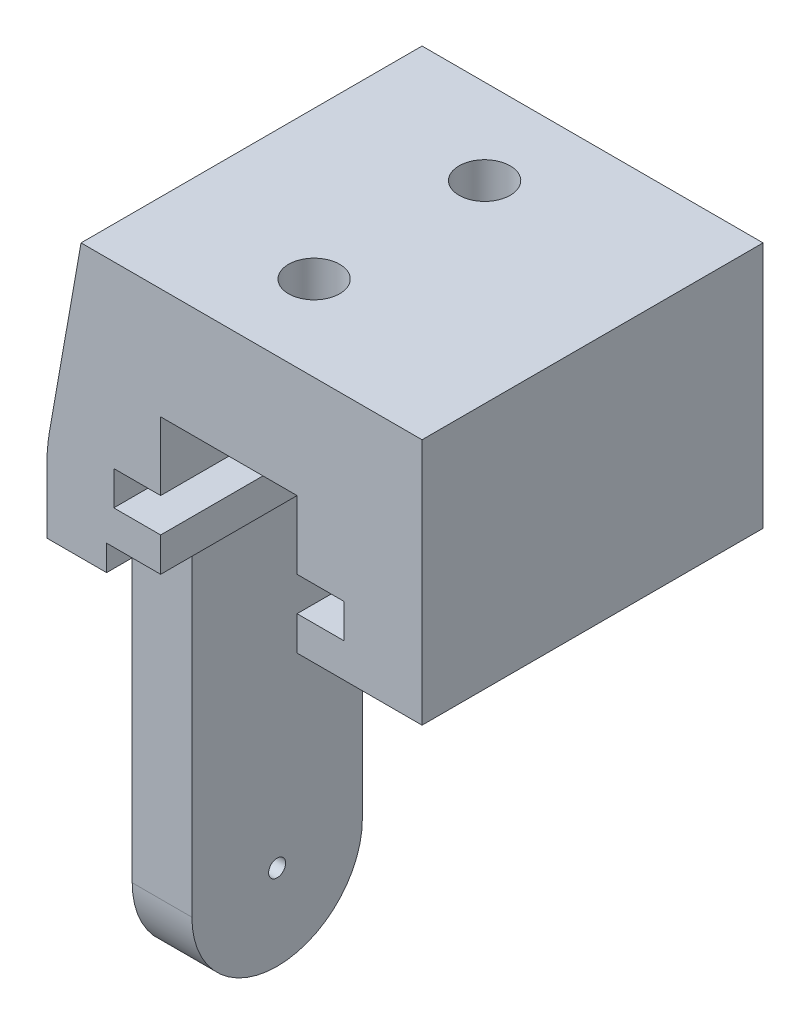
ISO-10303-21;
HEADER;
FILE_DESCRIPTION(('STEP AP214'),'2;1');
FILE_NAME('part.step','',(''),(''),'','','');
FILE_SCHEMA(('AUTOMOTIVE_DESIGN { 1 0 10303 214 1 1 1 1 }'));
ENDSEC;
DATA;
#1=APPLICATION_CONTEXT('core data for automotive mechanical design processes');
#2=APPLICATION_PROTOCOL_DEFINITION('international standard','automotive_design',2000,#1);
#3=PRODUCT_CONTEXT('',#1,'mechanical');
#4=PRODUCT('Part','Part','',(#3));
#5=PRODUCT_RELATED_PRODUCT_CATEGORY('part','',(#4));
#6=PRODUCT_DEFINITION_FORMATION('','',#4);
#7=PRODUCT_DEFINITION_CONTEXT('part definition',#1,'design');
#8=PRODUCT_DEFINITION('design','',#6,#7);
#9=PRODUCT_DEFINITION_SHAPE('','',#8);
#10=(LENGTH_UNIT() NAMED_UNIT(*) SI_UNIT(.MILLI.,.METRE.));
#11=(NAMED_UNIT(*) PLANE_ANGLE_UNIT() SI_UNIT($,.RADIAN.));
#12=(NAMED_UNIT(*) SI_UNIT($,.STERADIAN.) SOLID_ANGLE_UNIT());
#13=UNCERTAINTY_MEASURE_WITH_UNIT(LENGTH_MEASURE(1.E-05),#10,'distance_accuracy_value','');
#14=(GEOMETRIC_REPRESENTATION_CONTEXT(3) GLOBAL_UNCERTAINTY_ASSIGNED_CONTEXT((#13)) GLOBAL_UNIT_ASSIGNED_CONTEXT((#10,
#11,#12)) REPRESENTATION_CONTEXT('',''));
#15=CARTESIAN_POINT('',(0.,0.,0.));
#16=DIRECTION('',(0.,0.,1.));
#17=DIRECTION('',(1.,0.,0.));
#18=AXIS2_PLACEMENT_3D('',#15,#16,#17);
#19=CARTESIAN_POINT('',(0.,-16.,20.));
#20=DIRECTION('',(0.,1.,0.));
#21=DIRECTION('',(0.,0.,1.));
#22=AXIS2_PLACEMENT_3D('',#19,#20,#21);
#23=PLANE('',#22);
#24=DIRECTION('',(0.,0.,-1.));
#25=VECTOR('',#24,1.);
#26=CARTESIAN_POINT('',(0.,-16.,20.));
#27=LINE('',#26,#25);
#28=CARTESIAN_POINT('',(0.,-16.,20.));
#29=VERTEX_POINT('',#28);
#30=CARTESIAN_POINT('',(0.,-16.,16.));
#31=VERTEX_POINT('',#30);
#32=EDGE_CURVE('E349',#29,#31,#27,.T.);
#33=ORIENTED_EDGE('',*,*,#32,.T.);
#34=DIRECTION('',(-1.,0.,0.));
#35=VECTOR('',#34,1.);
#36=CARTESIAN_POINT('',(3.5,-16.,16.));
#37=LINE('',#36,#35);
#38=CARTESIAN_POINT('',(3.5,-16.,16.));
#39=VERTEX_POINT('',#38);
#40=EDGE_CURVE('E56',#31,#39,#37,.F.);
#41=ORIENTED_EDGE('',*,*,#40,.T.);
#42=DIRECTION('',(0.,0.,1.));
#43=VECTOR('',#42,1.);
#44=CARTESIAN_POINT('',(3.5,-16.,-20.7966343430854));
#45=LINE('',#44,#43);
#46=CARTESIAN_POINT('',(3.5,-16.,20.));
#47=VERTEX_POINT('',#46);
#48=EDGE_CURVE('E333',#39,#47,#45,.T.);
#49=ORIENTED_EDGE('',*,*,#48,.T.);
#50=DIRECTION('',(1.,0.,0.));
#51=VECTOR('',#50,1.);
#52=CARTESIAN_POINT('',(0.,-16.,20.));
#53=LINE('',#52,#51);
#54=EDGE_CURVE('E456',#29,#47,#53,.T.);
#55=ORIENTED_EDGE('',*,*,#54,.F.);
#56=EDGE_LOOP('',(#33,#41,#49,#55));
#57=FACE_BOUND('',#56,.T.);
#58=ADVANCED_FACE('F35',(#57),#23,.F.);
#59=CARTESIAN_POINT('',(3.5,-16.,0.));
#60=VERTEX_POINT('',#59);
#61=CARTESIAN_POINT('',(3.5,-16.,4.));
#62=VERTEX_POINT('',#61);
#63=EDGE_CURVE('E343',#60,#62,#45,.T.);
#64=ORIENTED_EDGE('',*,*,#63,.T.);
#65=DIRECTION('',(1.,0.,0.));
#66=VECTOR('',#65,1.);
#67=CARTESIAN_POINT('',(0.,-16.,4.));
#68=LINE('',#67,#66);
#69=CARTESIAN_POINT('',(0.,-16.,4.));
#70=VERTEX_POINT('',#69);
#71=EDGE_CURVE('E365',#62,#70,#68,.F.);
#72=ORIENTED_EDGE('',*,*,#71,.T.);
#73=CARTESIAN_POINT('',(0.,-16.,0.));
#74=VERTEX_POINT('',#73);
#75=EDGE_CURVE('E352',#70,#74,#27,.T.);
#76=ORIENTED_EDGE('',*,*,#75,.T.);
#77=DIRECTION('',(1.,0.,0.));
#78=VECTOR('',#77,1.);
#79=CARTESIAN_POINT('',(0.,-16.,0.));
#80=LINE('',#79,#78);
#81=EDGE_CURVE('E423',#74,#60,#80,.T.);
#82=ORIENTED_EDGE('',*,*,#81,.T.);
#83=EDGE_LOOP('',(#64,#72,#76,#82));
#84=FACE_BOUND('',#83,.T.);
#85=ADVANCED_FACE('F507',(#84),#23,.F.);
#86=CARTESIAN_POINT('',(22.,0.,20.));
#87=DIRECTION('',(-1.,0.,0.));
#88=DIRECTION('',(0.,-1.,0.));
#89=AXIS2_PLACEMENT_3D('',#86,#87,#88);
#90=PLANE('',#89);
#91=DIRECTION('',(0.,0.,1.));
#92=VECTOR('',#91,1.);
#93=CARTESIAN_POINT('',(22.,-14.5,-20.7966343430854));
#94=LINE('',#93,#92);
#95=CARTESIAN_POINT('',(22.,-14.5,0.));
#96=VERTEX_POINT('',#95);
#97=CARTESIAN_POINT('',(22.,-14.5,20.));
#98=VERTEX_POINT('',#97);
#99=EDGE_CURVE('E336',#96,#98,#94,.T.);
#100=ORIENTED_EDGE('',*,*,#99,.F.);
#101=DIRECTION('',(0.,1.,0.));
#102=VECTOR('',#101,1.);
#103=CARTESIAN_POINT('',(22.,0.,0.));
#104=LINE('',#103,#102);
#105=CARTESIAN_POINT('',(22.,0.,0.));
#106=VERTEX_POINT('',#105);
#107=EDGE_CURVE('E414',#96,#106,#104,.T.);
#108=ORIENTED_EDGE('',*,*,#107,.T.);
#109=DIRECTION('',(0.,0.,-1.));
#110=VECTOR('',#109,1.);
#111=CARTESIAN_POINT('',(22.,0.,20.));
#112=LINE('',#111,#110);
#113=CARTESIAN_POINT('',(22.,0.,20.));
#114=VERTEX_POINT('',#113);
#115=EDGE_CURVE('E357',#114,#106,#112,.T.);
#116=ORIENTED_EDGE('',*,*,#115,.F.);
#117=DIRECTION('',(0.,1.,0.));
#118=VECTOR('',#117,1.);
#119=CARTESIAN_POINT('',(22.,0.,20.));
#120=LINE('',#119,#118);
#121=EDGE_CURVE('E458',#98,#114,#120,.T.);
#122=ORIENTED_EDGE('',*,*,#121,.F.);
#123=EDGE_LOOP('',(#100,#108,#116,#122));
#124=FACE_BOUND('',#123,.T.);
#125=ADVANCED_FACE('F431',(#124),#90,.F.);
#126=CARTESIAN_POINT('',(0.,0.,20.));
#127=DIRECTION('',(0.,0.,1.));
#128=DIRECTION('',(1.,0.,0.));
#129=AXIS2_PLACEMENT_3D('',#126,#127,#128);
#130=PLANE('',#129);
#131=DIRECTION('',(0.173648177666931,0.984807753012208,0.));
#132=VECTOR('',#131,1.);
#133=CARTESIAN_POINT('',(1.93969262078591,-0.34202014332567,20.));
#134=LINE('',#133,#132);
#135=CARTESIAN_POINT('',(2.,0.,20.));
#136=VERTEX_POINT('',#135);
#137=CARTESIAN_POINT('',(0.151922469877919,-10.4809684978253,20.));
#138=VERTEX_POINT('',#137);
#139=EDGE_CURVE('E397',#136,#138,#134,.F.);
#140=ORIENTED_EDGE('',*,*,#139,.T.);
#141=CARTESIAN_POINT('',(10.,-12.2174502744946,20.));
#142=DIRECTION('',(0.,0.,1.));
#143=DIRECTION('',(1.,0.,0.));
#144=AXIS2_PLACEMENT_3D('',#141,#142,#143);
#145=CIRCLE('',#144,10.);
#146=CARTESIAN_POINT('',(0.,-12.2174502744946,20.));
#147=VERTEX_POINT('',#146);
#148=EDGE_CURVE('E347',#138,#147,#145,.T.);
#149=ORIENTED_EDGE('',*,*,#148,.T.);
#150=DIRECTION('',(0.,-1.,0.));
#151=VECTOR('',#150,1.);
#152=CARTESIAN_POINT('',(0.,0.,20.));
#153=LINE('',#152,#151);
#154=EDGE_CURVE('E413',#147,#29,#153,.T.);
#155=ORIENTED_EDGE('',*,*,#154,.T.);
#156=ORIENTED_EDGE('',*,*,#54,.T.);
#157=DIRECTION('',(0.,1.,0.));
#158=VECTOR('',#157,1.);
#159=CARTESIAN_POINT('',(3.5,-16.,20.));
#160=LINE('',#159,#158);
#161=CARTESIAN_POINT('',(3.5,-14.5,20.));
#162=VERTEX_POINT('',#161);
#163=EDGE_CURVE('E303',#47,#162,#160,.T.);
#164=ORIENTED_EDGE('',*,*,#163,.T.);
#165=DIRECTION('',(1.,0.,0.));
#166=VECTOR('',#165,1.);
#167=CARTESIAN_POINT('',(3.5,-14.5,20.));
#168=LINE('',#167,#166);
#169=CARTESIAN_POINT('',(6.67,-14.5,20.));
#170=VERTEX_POINT('',#169);
#171=EDGE_CURVE('E306',#162,#170,#168,.T.);
#172=ORIENTED_EDGE('',*,*,#171,.T.);
#173=DIRECTION('',(0.,1.,0.));
#174=VECTOR('',#173,1.);
#175=CARTESIAN_POINT('',(6.67,-14.5,20.));
#176=LINE('',#175,#174);
#177=CARTESIAN_POINT('',(6.67,-12.5,20.));
#178=VERTEX_POINT('',#177);
#179=EDGE_CURVE('E309',#170,#178,#176,.T.);
#180=ORIENTED_EDGE('',*,*,#179,.T.);
#181=DIRECTION('',(-1.,0.,0.));
#182=VECTOR('',#181,1.);
#183=CARTESIAN_POINT('',(6.67,-12.5,20.));
#184=LINE('',#183,#182);
#185=CARTESIAN_POINT('',(3.92,-12.5,20.));
#186=VERTEX_POINT('',#185);
#187=EDGE_CURVE('E312',#178,#186,#184,.T.);
#188=ORIENTED_EDGE('',*,*,#187,.T.);
#189=DIRECTION('',(0.,1.,0.));
#190=VECTOR('',#189,1.);
#191=CARTESIAN_POINT('',(3.92,-12.5,20.));
#192=LINE('',#191,#190);
#193=CARTESIAN_POINT('',(3.92,-10.5,20.));
#194=VERTEX_POINT('',#193);
#195=EDGE_CURVE('E315',#186,#194,#192,.T.);
#196=ORIENTED_EDGE('',*,*,#195,.T.);
#197=DIRECTION('',(1.,0.,0.));
#198=VECTOR('',#197,1.);
#199=CARTESIAN_POINT('',(3.92,-10.5,20.));
#200=LINE('',#199,#198);
#201=CARTESIAN_POINT('',(6.67,-10.5,20.));
#202=VERTEX_POINT('',#201);
#203=EDGE_CURVE('E318',#194,#202,#200,.T.);
#204=ORIENTED_EDGE('',*,*,#203,.T.);
#205=DIRECTION('',(0.,1.,0.));
#206=VECTOR('',#205,1.);
#207=CARTESIAN_POINT('',(6.67,-10.5,20.));
#208=LINE('',#207,#206);
#209=CARTESIAN_POINT('',(6.67,-6.5,20.));
#210=VERTEX_POINT('',#209);
#211=EDGE_CURVE('E279',#202,#210,#208,.T.);
#212=ORIENTED_EDGE('',*,*,#211,.T.);
#213=DIRECTION('',(1.,0.,0.));
#214=VECTOR('',#213,1.);
#215=CARTESIAN_POINT('',(6.67,-6.5,20.));
#216=LINE('',#215,#214);
#217=CARTESIAN_POINT('',(14.67,-6.5,20.));
#218=VERTEX_POINT('',#217);
#219=EDGE_CURVE('E282',#210,#218,#216,.T.);
#220=ORIENTED_EDGE('',*,*,#219,.T.);
#221=DIRECTION('',(0.,-1.,0.));
#222=VECTOR('',#221,1.);
#223=CARTESIAN_POINT('',(14.67,-6.5,20.));
#224=LINE('',#223,#222);
#225=CARTESIAN_POINT('',(14.67,-10.5,20.));
#226=VERTEX_POINT('',#225);
#227=EDGE_CURVE('E285',#218,#226,#224,.T.);
#228=ORIENTED_EDGE('',*,*,#227,.T.);
#229=DIRECTION('',(1.,0.,0.));
#230=VECTOR('',#229,1.);
#231=CARTESIAN_POINT('',(14.67,-10.5,20.));
#232=LINE('',#231,#230);
#233=CARTESIAN_POINT('',(17.42,-10.5,20.));
#234=VERTEX_POINT('',#233);
#235=EDGE_CURVE('E288',#226,#234,#232,.T.);
#236=ORIENTED_EDGE('',*,*,#235,.T.);
#237=DIRECTION('',(0.,-1.,0.));
#238=VECTOR('',#237,1.);
#239=CARTESIAN_POINT('',(17.42,-10.5,20.));
#240=LINE('',#239,#238);
#241=CARTESIAN_POINT('',(17.42,-12.5,20.));
#242=VERTEX_POINT('',#241);
#243=EDGE_CURVE('E291',#234,#242,#240,.T.);
#244=ORIENTED_EDGE('',*,*,#243,.T.);
#245=DIRECTION('',(-1.,0.,0.));
#246=VECTOR('',#245,1.);
#247=CARTESIAN_POINT('',(17.42,-12.5,20.));
#248=LINE('',#247,#246);
#249=CARTESIAN_POINT('',(14.67,-12.5,20.));
#250=VERTEX_POINT('',#249);
#251=EDGE_CURVE('E294',#242,#250,#248,.T.);
#252=ORIENTED_EDGE('',*,*,#251,.T.);
#253=DIRECTION('',(0.,-1.,0.));
#254=VECTOR('',#253,1.);
#255=CARTESIAN_POINT('',(14.67,-12.5,20.));
#256=LINE('',#255,#254);
#257=CARTESIAN_POINT('',(14.67,-14.5,20.));
#258=VERTEX_POINT('',#257);
#259=EDGE_CURVE('E297',#250,#258,#256,.T.);
#260=ORIENTED_EDGE('',*,*,#259,.T.);
#261=DIRECTION('',(1.,0.,0.));
#262=VECTOR('',#261,1.);
#263=CARTESIAN_POINT('',(14.67,-14.5,20.));
#264=LINE('',#263,#262);
#265=EDGE_CURVE('E300',#258,#98,#264,.T.);
#266=ORIENTED_EDGE('',*,*,#265,.T.);
#267=ORIENTED_EDGE('',*,*,#121,.T.);
#268=DIRECTION('',(-1.,0.,0.));
#269=VECTOR('',#268,1.);
#270=CARTESIAN_POINT('',(0.,0.,20.));
#271=LINE('',#270,#269);
#272=EDGE_CURVE('E417',#114,#136,#271,.T.);
#273=ORIENTED_EDGE('',*,*,#272,.T.);
#274=EDGE_LOOP('',(#140,#149,#155,#156,#164,#172,#180,#188,#196,#204,#212,#220,#228,#236,#244,
#252,#260,#266,#267,#273));
#275=FACE_BOUND('',#274,.T.);
#276=ADVANCED_FACE('F416',(#275),#130,.T.);
#277=CARTESIAN_POINT('',(0.,0.,0.));
#278=DIRECTION('',(0.,0.,1.));
#279=DIRECTION('',(1.,0.,0.));
#280=AXIS2_PLACEMENT_3D('',#277,#278,#279);
#281=PLANE('',#280);
#282=DIRECTION('',(0.,-1.,0.));
#283=VECTOR('',#282,1.);
#284=CARTESIAN_POINT('',(0.,0.,0.));
#285=LINE('',#284,#283);
#286=CARTESIAN_POINT('',(0.,-12.2174502744946,0.));
#287=VERTEX_POINT('',#286);
#288=EDGE_CURVE('E278',#287,#74,#285,.T.);
#289=ORIENTED_EDGE('',*,*,#288,.F.);
#290=CARTESIAN_POINT('',(10.,-12.2174502744946,0.));
#291=DIRECTION('',(0.,0.,1.));
#292=DIRECTION('',(1.,0.,0.));
#293=AXIS2_PLACEMENT_3D('',#290,#291,#292);
#294=CIRCLE('',#293,10.);
#295=CARTESIAN_POINT('',(0.151922469877919,-10.4809684978253,0.));
#296=VERTEX_POINT('',#295);
#297=EDGE_CURVE('E387',#287,#296,#294,.F.);
#298=ORIENTED_EDGE('',*,*,#297,.T.);
#299=DIRECTION('',(-0.173648177666931,-0.984807753012208,0.));
#300=VECTOR('',#299,1.);
#301=CARTESIAN_POINT('',(0.,-11.3425636392354,0.));
#302=LINE('',#301,#300);
#303=CARTESIAN_POINT('',(2.,0.,0.));
#304=VERTEX_POINT('',#303);
#305=EDGE_CURVE('E351',#296,#304,#302,.F.);
#306=ORIENTED_EDGE('',*,*,#305,.T.);
#307=DIRECTION('',(-1.,0.,0.));
#308=VECTOR('',#307,1.);
#309=CARTESIAN_POINT('',(0.,0.,0.));
#310=LINE('',#309,#308);
#311=EDGE_CURVE('E409',#106,#304,#310,.T.);
#312=ORIENTED_EDGE('',*,*,#311,.F.);
#313=ORIENTED_EDGE('',*,*,#107,.F.);
#314=DIRECTION('',(-1.,0.,0.));
#315=VECTOR('',#314,1.);
#316=CARTESIAN_POINT('',(14.67,-14.5,0.));
#317=LINE('',#316,#315);
#318=CARTESIAN_POINT('',(14.67,-14.5,0.));
#319=VERTEX_POINT('',#318);
#320=EDGE_CURVE('E254',#96,#319,#317,.T.);
#321=ORIENTED_EDGE('',*,*,#320,.T.);
#322=DIRECTION('',(0.,1.,0.));
#323=VECTOR('',#322,1.);
#324=CARTESIAN_POINT('',(14.67,-12.5,0.));
#325=LINE('',#324,#323);
#326=CARTESIAN_POINT('',(14.67,-12.5,0.));
#327=VERTEX_POINT('',#326);
#328=EDGE_CURVE('E257',#319,#327,#325,.T.);
#329=ORIENTED_EDGE('',*,*,#328,.T.);
#330=DIRECTION('',(1.,0.,0.));
#331=VECTOR('',#330,1.);
#332=CARTESIAN_POINT('',(17.42,-12.5,0.));
#333=LINE('',#332,#331);
#334=CARTESIAN_POINT('',(17.42,-12.5,0.));
#335=VERTEX_POINT('',#334);
#336=EDGE_CURVE('E260',#327,#335,#333,.T.);
#337=ORIENTED_EDGE('',*,*,#336,.T.);
#338=DIRECTION('',(0.,1.,0.));
#339=VECTOR('',#338,1.);
#340=CARTESIAN_POINT('',(17.42,-10.5,0.));
#341=LINE('',#340,#339);
#342=CARTESIAN_POINT('',(17.42,-10.5,0.));
#343=VERTEX_POINT('',#342);
#344=EDGE_CURVE('E263',#335,#343,#341,.T.);
#345=ORIENTED_EDGE('',*,*,#344,.T.);
#346=DIRECTION('',(-1.,0.,0.));
#347=VECTOR('',#346,1.);
#348=CARTESIAN_POINT('',(14.67,-10.5,0.));
#349=LINE('',#348,#347);
#350=CARTESIAN_POINT('',(14.67,-10.5,0.));
#351=VERTEX_POINT('',#350);
#352=EDGE_CURVE('E266',#343,#351,#349,.T.);
#353=ORIENTED_EDGE('',*,*,#352,.T.);
#354=DIRECTION('',(0.,1.,0.));
#355=VECTOR('',#354,1.);
#356=CARTESIAN_POINT('',(14.67,-6.5,0.));
#357=LINE('',#356,#355);
#358=CARTESIAN_POINT('',(14.67,-6.5,0.));
#359=VERTEX_POINT('',#358);
#360=EDGE_CURVE('E269',#351,#359,#357,.T.);
#361=ORIENTED_EDGE('',*,*,#360,.T.);
#362=DIRECTION('',(-1.,0.,0.));
#363=VECTOR('',#362,1.);
#364=CARTESIAN_POINT('',(6.67,-6.5,0.));
#365=LINE('',#364,#363);
#366=CARTESIAN_POINT('',(6.67,-6.5,0.));
#367=VERTEX_POINT('',#366);
#368=EDGE_CURVE('E272',#359,#367,#365,.T.);
#369=ORIENTED_EDGE('',*,*,#368,.T.);
#370=DIRECTION('',(0.,-1.,0.));
#371=VECTOR('',#370,1.);
#372=CARTESIAN_POINT('',(6.67,-10.5,0.));
#373=LINE('',#372,#371);
#374=CARTESIAN_POINT('',(6.67,-10.5,0.));
#375=VERTEX_POINT('',#374);
#376=EDGE_CURVE('E275',#367,#375,#373,.T.);
#377=ORIENTED_EDGE('',*,*,#376,.T.);
#378=DIRECTION('',(-1.,0.,0.));
#379=VECTOR('',#378,1.);
#380=CARTESIAN_POINT('',(3.92,-10.5,0.));
#381=LINE('',#380,#379);
#382=CARTESIAN_POINT('',(3.92,-10.5,0.));
#383=VERTEX_POINT('',#382);
#384=EDGE_CURVE('E242',#375,#383,#381,.T.);
#385=ORIENTED_EDGE('',*,*,#384,.T.);
#386=DIRECTION('',(0.,-1.,0.));
#387=VECTOR('',#386,1.);
#388=CARTESIAN_POINT('',(3.92,-12.5,0.));
#389=LINE('',#388,#387);
#390=CARTESIAN_POINT('',(3.92,-12.5,0.));
#391=VERTEX_POINT('',#390);
#392=EDGE_CURVE('E238',#383,#391,#389,.T.);
#393=ORIENTED_EDGE('',*,*,#392,.T.);
#394=DIRECTION('',(1.,0.,0.));
#395=VECTOR('',#394,1.);
#396=CARTESIAN_POINT('',(6.67,-12.5,0.));
#397=LINE('',#396,#395);
#398=CARTESIAN_POINT('',(6.67,-12.5,0.));
#399=VERTEX_POINT('',#398);
#400=EDGE_CURVE('E241',#391,#399,#397,.T.);
#401=ORIENTED_EDGE('',*,*,#400,.T.);
#402=DIRECTION('',(0.,-1.,0.));
#403=VECTOR('',#402,1.);
#404=CARTESIAN_POINT('',(6.67,-14.5,0.));
#405=LINE('',#404,#403);
#406=CARTESIAN_POINT('',(6.67,-14.5,0.));
#407=VERTEX_POINT('',#406);
#408=EDGE_CURVE('E245',#399,#407,#405,.T.);
#409=ORIENTED_EDGE('',*,*,#408,.T.);
#410=DIRECTION('',(-1.,0.,0.));
#411=VECTOR('',#410,1.);
#412=CARTESIAN_POINT('',(3.5,-14.5,0.));
#413=LINE('',#412,#411);
#414=CARTESIAN_POINT('',(3.5,-14.5,0.));
#415=VERTEX_POINT('',#414);
#416=EDGE_CURVE('E248',#407,#415,#413,.T.);
#417=ORIENTED_EDGE('',*,*,#416,.T.);
#418=DIRECTION('',(0.,-1.,0.));
#419=VECTOR('',#418,1.);
#420=CARTESIAN_POINT('',(3.5,-16.,0.));
#421=LINE('',#420,#419);
#422=EDGE_CURVE('E251',#415,#60,#421,.T.);
#423=ORIENTED_EDGE('',*,*,#422,.T.);
#424=ORIENTED_EDGE('',*,*,#81,.F.);
#425=EDGE_LOOP('',(#289,#298,#306,#312,#313,#321,#329,#337,#345,#353,#361,#369,#377,#385,#393,
#401,#409,#417,#423,#424));
#426=FACE_BOUND('',#425,.T.);
#427=ADVANCED_FACE('F407',(#426),#281,.F.);
#428=CARTESIAN_POINT('',(0.,0.,20.));
#429=DIRECTION('',(1.,0.,0.));
#430=DIRECTION('',(0.,1.,0.));
#431=AXIS2_PLACEMENT_3D('',#428,#429,#430);
#432=PLANE('',#431);
#433=CARTESIAN_POINT('',(0.,-36.,10.));
#434=DIRECTION('',(-1.,0.,0.));
#435=DIRECTION('',(0.,-1.,0.));
#436=AXIS2_PLACEMENT_3D('',#433,#434,#435);
#437=CIRCLE('',#436,0.500000000000001);
#438=CARTESIAN_POINT('',(0.,-36.5,10.));
#439=VERTEX_POINT('',#438);
#440=EDGE_CURVE('E583',#439,#439,#437,.T.);
#441=ORIENTED_EDGE('',*,*,#440,.F.);
#442=EDGE_LOOP('',(#441));
#443=FACE_BOUND('',#442,.T.);
#444=ORIENTED_EDGE('',*,*,#154,.F.);
#445=DIRECTION('',(0.,0.,1.));
#446=VECTOR('',#445,1.);
#447=CARTESIAN_POINT('',(0.,-12.2174502744946,0.));
#448=LINE('',#447,#446);
#449=EDGE_CURVE('E392',#147,#287,#448,.F.);
#450=ORIENTED_EDGE('',*,*,#449,.T.);
#451=ORIENTED_EDGE('',*,*,#288,.T.);
#452=ORIENTED_EDGE('',*,*,#75,.F.);
#453=CARTESIAN_POINT('',(0.,-17.,4.));
#454=DIRECTION('',(1.,0.,0.));
#455=DIRECTION('',(0.,1.,0.));
#456=AXIS2_PLACEMENT_3D('',#453,#454,#455);
#457=CIRCLE('',#456,1.);
#458=CARTESIAN_POINT('',(0.,-17.,5.));
#459=VERTEX_POINT('',#458);
#460=EDGE_CURVE('E371',#70,#459,#457,.T.);
#461=ORIENTED_EDGE('',*,*,#460,.T.);
#462=DIRECTION('',(0.,1.,0.));
#463=VECTOR('',#462,1.);
#464=CARTESIAN_POINT('',(0.,-36.,5.));
#465=LINE('',#464,#463);
#466=CARTESIAN_POINT('',(0.,-36.,5.));
#467=VERTEX_POINT('',#466);
#468=EDGE_CURVE('E217',#467,#459,#465,.T.);
#469=ORIENTED_EDGE('',*,*,#468,.F.);
#470=CARTESIAN_POINT('',(0.,-36.,10.));
#471=DIRECTION('',(-1.,0.,0.));
#472=DIRECTION('',(0.,1.,0.));
#473=AXIS2_PLACEMENT_3D('',#470,#471,#472);
#474=CIRCLE('',#473,5.);
#475=CARTESIAN_POINT('',(0.,-36.,15.));
#476=VERTEX_POINT('',#475);
#477=EDGE_CURVE('E227',#467,#476,#474,.T.);
#478=ORIENTED_EDGE('',*,*,#477,.T.);
#479=DIRECTION('',(0.,1.,0.));
#480=VECTOR('',#479,1.);
#481=CARTESIAN_POINT('',(0.,-36.,15.));
#482=LINE('',#481,#480);
#483=CARTESIAN_POINT('',(0.,-17.,15.));
#484=VERTEX_POINT('',#483);
#485=EDGE_CURVE('E234',#476,#484,#482,.T.);
#486=ORIENTED_EDGE('',*,*,#485,.T.);
#487=CARTESIAN_POINT('',(0.,-17.,16.));
#488=DIRECTION('',(1.,0.,0.));
#489=DIRECTION('',(0.,1.,0.));
#490=AXIS2_PLACEMENT_3D('',#487,#488,#489);
#491=CIRCLE('',#490,1.);
#492=EDGE_CURVE('E43',#484,#31,#491,.T.);
#493=ORIENTED_EDGE('',*,*,#492,.T.);
#494=ORIENTED_EDGE('',*,*,#32,.F.);
#495=EDGE_LOOP('',(#444,#450,#451,#452,#461,#469,#478,#486,#493,#494));
#496=FACE_BOUND('',#495,.T.);
#497=ADVANCED_FACE('F377',(#443,#496),#432,.F.);
#498=CARTESIAN_POINT('',(0.,0.,20.));
#499=DIRECTION('',(0.,-1.,0.));
#500=DIRECTION('',(0.,0.,-1.));
#501=AXIS2_PLACEMENT_3D('',#498,#499,#500);
#502=PLANE('',#501);
#503=CARTESIAN_POINT('',(10.67,0.,5.));
#504=DIRECTION('',(0.,-1.,0.));
#505=DIRECTION('',(0.,0.,-1.));
#506=AXIS2_PLACEMENT_3D('',#503,#504,#505);
#507=CIRCLE('',#506,1.5);
#508=CARTESIAN_POINT('',(10.67,0.,3.5));
#509=VERTEX_POINT('',#508);
#510=EDGE_CURVE('E578',#509,#509,#507,.F.);
#511=ORIENTED_EDGE('',*,*,#510,.F.);
#512=EDGE_LOOP('',(#511));
#513=FACE_BOUND('',#512,.T.);
#514=CARTESIAN_POINT('',(10.67,0.,15.));
#515=DIRECTION('',(0.,-1.,0.));
#516=DIRECTION('',(0.,0.,-1.));
#517=AXIS2_PLACEMENT_3D('',#514,#515,#516);
#518=CIRCLE('',#517,1.5);
#519=CARTESIAN_POINT('',(10.67,0.,13.5));
#520=VERTEX_POINT('',#519);
#521=EDGE_CURVE('E581',#520,#520,#518,.F.);
#522=ORIENTED_EDGE('',*,*,#521,.F.);
#523=EDGE_LOOP('',(#522));
#524=FACE_BOUND('',#523,.T.);
#525=ORIENTED_EDGE('',*,*,#311,.T.);
#526=DIRECTION('',(0.,0.,1.));
#527=VECTOR('',#526,1.);
#528=CARTESIAN_POINT('',(2.,0.,20.));
#529=LINE('',#528,#527);
#530=EDGE_CURVE('E398',#304,#136,#529,.T.);
#531=ORIENTED_EDGE('',*,*,#530,.T.);
#532=ORIENTED_EDGE('',*,*,#272,.F.);
#533=ORIENTED_EDGE('',*,*,#115,.T.);
#534=EDGE_LOOP('',(#525,#531,#532,#533));
#535=FACE_BOUND('',#534,.T.);
#536=ADVANCED_FACE('F411',(#513,#524,#535),#502,.F.);
#537=CARTESIAN_POINT('',(0.,-11.3425636392354,20.));
#538=DIRECTION('',(0.984807753012208,-0.173648177666931,0.));
#539=DIRECTION('',(0.,0.,-1.));
#540=AXIS2_PLACEMENT_3D('',#537,#538,#539);
#541=PLANE('',#540);
#542=ORIENTED_EDGE('',*,*,#305,.F.);
#543=DIRECTION('',(0.,0.,-1.));
#544=VECTOR('',#543,1.);
#545=CARTESIAN_POINT('',(0.151922469877919,-10.4809684978253,20.));
#546=LINE('',#545,#544);
#547=EDGE_CURVE('E383',#296,#138,#546,.F.);
#548=ORIENTED_EDGE('',*,*,#547,.T.);
#549=ORIENTED_EDGE('',*,*,#139,.F.);
#550=ORIENTED_EDGE('',*,*,#530,.F.);
#551=EDGE_LOOP('',(#542,#548,#549,#550));
#552=FACE_BOUND('',#551,.T.);
#553=ADVANCED_FACE('F415',(#552),#541,.F.);
#554=CARTESIAN_POINT('',(3.92,-10.5,-20.7966343430854));
#555=DIRECTION('',(0.,-1.,0.));
#556=DIRECTION('',(1.,0.,0.));
#557=AXIS2_PLACEMENT_3D('',#554,#555,#556);
#558=PLANE('',#557);
#559=DIRECTION('',(0.,0.,1.));
#560=VECTOR('',#559,1.);
#561=CARTESIAN_POINT('',(6.67,-10.5,-20.7966343430854));
#562=LINE('',#561,#560);
#563=EDGE_CURVE('E321',#375,#202,#562,.T.);
#564=ORIENTED_EDGE('',*,*,#563,.T.);
#565=ORIENTED_EDGE('',*,*,#203,.F.);
#566=DIRECTION('',(0.,0.,1.));
#567=VECTOR('',#566,1.);
#568=CARTESIAN_POINT('',(3.92,-10.5,-20.7966343430854));
#569=LINE('',#568,#567);
#570=EDGE_CURVE('E323',#383,#194,#569,.T.);
#571=ORIENTED_EDGE('',*,*,#570,.F.);
#572=ORIENTED_EDGE('',*,*,#384,.F.);
#573=EDGE_LOOP('',(#564,#565,#571,#572));
#574=FACE_BOUND('',#573,.T.);
#575=ADVANCED_FACE('F488',(#574),#558,.T.);
#576=CARTESIAN_POINT('',(3.92,-12.5,-20.7966343430854));
#577=DIRECTION('',(1.,0.,0.));
#578=DIRECTION('',(0.,0.,-1.));
#579=AXIS2_PLACEMENT_3D('',#576,#577,#578);
#580=PLANE('',#579);
#581=ORIENTED_EDGE('',*,*,#570,.T.);
#582=ORIENTED_EDGE('',*,*,#195,.F.);
#583=DIRECTION('',(0.,0.,1.));
#584=VECTOR('',#583,1.);
#585=CARTESIAN_POINT('',(3.92,-12.5,-20.7966343430854));
#586=LINE('',#585,#584);
#587=EDGE_CURVE('E325',#391,#186,#586,.T.);
#588=ORIENTED_EDGE('',*,*,#587,.F.);
#589=ORIENTED_EDGE('',*,*,#392,.F.);
#590=EDGE_LOOP('',(#581,#582,#588,#589));
#591=FACE_BOUND('',#590,.T.);
#592=ADVANCED_FACE('F491',(#591),#580,.T.);
#593=CARTESIAN_POINT('',(6.67,-12.5,-20.7966343430854));
#594=DIRECTION('',(0.,1.,0.));
#595=DIRECTION('',(-1.,0.,0.));
#596=AXIS2_PLACEMENT_3D('',#593,#594,#595);
#597=PLANE('',#596);
#598=ORIENTED_EDGE('',*,*,#587,.T.);
#599=ORIENTED_EDGE('',*,*,#187,.F.);
#600=DIRECTION('',(0.,0.,1.));
#601=VECTOR('',#600,1.);
#602=CARTESIAN_POINT('',(6.67,-12.5,-20.7966343430854));
#603=LINE('',#602,#601);
#604=EDGE_CURVE('E327',#399,#178,#603,.T.);
#605=ORIENTED_EDGE('',*,*,#604,.F.);
#606=ORIENTED_EDGE('',*,*,#400,.F.);
#607=EDGE_LOOP('',(#598,#599,#605,#606));
#608=FACE_BOUND('',#607,.T.);
#609=ADVANCED_FACE('F495',(#608),#597,.T.);
#610=CARTESIAN_POINT('',(6.67,-14.5,-20.7966343430854));
#611=DIRECTION('',(1.,0.,0.));
#612=DIRECTION('',(0.,0.,-1.));
#613=AXIS2_PLACEMENT_3D('',#610,#611,#612);
#614=PLANE('',#613);
#615=ORIENTED_EDGE('',*,*,#604,.T.);
#616=ORIENTED_EDGE('',*,*,#179,.F.);
#617=DIRECTION('',(0.,0.,1.));
#618=VECTOR('',#617,1.);
#619=CARTESIAN_POINT('',(6.67,-14.5,-20.7966343430854));
#620=LINE('',#619,#618);
#621=EDGE_CURVE('E329',#407,#170,#620,.T.);
#622=ORIENTED_EDGE('',*,*,#621,.F.);
#623=ORIENTED_EDGE('',*,*,#408,.F.);
#624=EDGE_LOOP('',(#615,#616,#622,#623));
#625=FACE_BOUND('',#624,.T.);
#626=ADVANCED_FACE('F499',(#625),#614,.T.);
#627=CARTESIAN_POINT('',(3.5,-14.5,-20.7966343430854));
#628=DIRECTION('',(0.,-1.,0.));
#629=DIRECTION('',(0.,0.,-1.));
#630=AXIS2_PLACEMENT_3D('',#627,#628,#629);
#631=PLANE('',#630);
#632=ORIENTED_EDGE('',*,*,#621,.T.);
#633=ORIENTED_EDGE('',*,*,#171,.F.);
#634=DIRECTION('',(0.,0.,1.));
#635=VECTOR('',#634,1.);
#636=CARTESIAN_POINT('',(3.5,-14.5,-20.7966343430854));
#637=LINE('',#636,#635);
#638=EDGE_CURVE('E331',#415,#162,#637,.T.);
#639=ORIENTED_EDGE('',*,*,#638,.F.);
#640=ORIENTED_EDGE('',*,*,#416,.F.);
#641=EDGE_LOOP('',(#632,#633,#639,#640));
#642=FACE_BOUND('',#641,.T.);
#643=ADVANCED_FACE('F503',(#642),#631,.T.);
#644=CARTESIAN_POINT('',(3.5,-16.,-20.7966343430854));
#645=DIRECTION('',(1.,0.,0.));
#646=DIRECTION('',(0.,0.,-1.));
#647=AXIS2_PLACEMENT_3D('',#644,#645,#646);
#648=PLANE('',#647);
#649=CARTESIAN_POINT('',(3.5,-36.,10.));
#650=DIRECTION('',(1.,0.,0.));
#651=DIRECTION('',(0.,0.,-1.));
#652=AXIS2_PLACEMENT_3D('',#649,#650,#651);
#653=CIRCLE('',#652,0.500000000000001);
#654=CARTESIAN_POINT('',(3.5,-36.,9.5));
#655=VERTEX_POINT('',#654);
#656=EDGE_CURVE('E587',#655,#655,#653,.F.);
#657=ORIENTED_EDGE('',*,*,#656,.T.);
#658=EDGE_LOOP('',(#657));
#659=FACE_BOUND('',#658,.T.);
#660=ORIENTED_EDGE('',*,*,#638,.T.);
#661=ORIENTED_EDGE('',*,*,#163,.F.);
#662=ORIENTED_EDGE('',*,*,#48,.F.);
#663=CARTESIAN_POINT('',(3.5,-17.,16.));
#664=DIRECTION('',(1.,0.,0.));
#665=DIRECTION('',(0.,0.,-1.));
#666=AXIS2_PLACEMENT_3D('',#663,#664,#665);
#667=CIRCLE('',#666,1.);
#668=CARTESIAN_POINT('',(3.5,-17.,15.));
#669=VERTEX_POINT('',#668);
#670=EDGE_CURVE('E11',#39,#669,#667,.F.);
#671=ORIENTED_EDGE('',*,*,#670,.T.);
#672=DIRECTION('',(0.,1.,0.));
#673=VECTOR('',#672,1.);
#674=CARTESIAN_POINT('',(3.5,-36.,15.));
#675=LINE('',#674,#673);
#676=CARTESIAN_POINT('',(3.5,-36.,15.));
#677=VERTEX_POINT('',#676);
#678=EDGE_CURVE('E218',#677,#669,#675,.T.);
#679=ORIENTED_EDGE('',*,*,#678,.F.);
#680=CARTESIAN_POINT('',(3.5,-36.,10.));
#681=DIRECTION('',(1.,0.,0.));
#682=DIRECTION('',(0.,0.,-1.));
#683=AXIS2_PLACEMENT_3D('',#680,#681,#682);
#684=CIRCLE('',#683,5.);
#685=CARTESIAN_POINT('',(3.50000000000001,-36.,5.));
#686=VERTEX_POINT('',#685);
#687=EDGE_CURVE('E221',#686,#677,#684,.F.);
#688=ORIENTED_EDGE('',*,*,#687,.F.);
#689=DIRECTION('',(0.,1.,0.));
#690=VECTOR('',#689,1.);
#691=CARTESIAN_POINT('',(3.5,-36.,5.));
#692=LINE('',#691,#690);
#693=CARTESIAN_POINT('',(3.5,-17.,5.));
#694=VERTEX_POINT('',#693);
#695=EDGE_CURVE('E207',#686,#694,#692,.T.);
#696=ORIENTED_EDGE('',*,*,#695,.T.);
#697=CARTESIAN_POINT('',(3.5,-17.,4.));
#698=DIRECTION('',(1.,0.,0.));
#699=DIRECTION('',(0.,0.,-1.));
#700=AXIS2_PLACEMENT_3D('',#697,#698,#699);
#701=CIRCLE('',#700,1.);
#702=EDGE_CURVE('E370',#694,#62,#701,.F.);
#703=ORIENTED_EDGE('',*,*,#702,.T.);
#704=ORIENTED_EDGE('',*,*,#63,.F.);
#705=ORIENTED_EDGE('',*,*,#422,.F.);
#706=EDGE_LOOP('',(#660,#661,#662,#671,#679,#688,#696,#703,#704,#705));
#707=FACE_BOUND('',#706,.T.);
#708=ADVANCED_FACE('F222',(#659,#707),#648,.T.);
#709=CARTESIAN_POINT('',(14.67,-14.5,-20.7966343430854));
#710=DIRECTION('',(0.,-1.,0.));
#711=DIRECTION('',(0.,0.,-1.));
#712=AXIS2_PLACEMENT_3D('',#709,#710,#711);
#713=PLANE('',#712);
#714=ORIENTED_EDGE('',*,*,#99,.T.);
#715=ORIENTED_EDGE('',*,*,#265,.F.);
#716=DIRECTION('',(0.,0.,1.));
#717=VECTOR('',#716,1.);
#718=CARTESIAN_POINT('',(14.67,-14.5,-20.7966343430854));
#719=LINE('',#718,#717);
#720=EDGE_CURVE('E437',#319,#258,#719,.T.);
#721=ORIENTED_EDGE('',*,*,#720,.F.);
#722=ORIENTED_EDGE('',*,*,#320,.F.);
#723=EDGE_LOOP('',(#714,#715,#721,#722));
#724=FACE_BOUND('',#723,.T.);
#725=ADVANCED_FACE('F435',(#724),#713,.T.);
#726=CARTESIAN_POINT('',(14.67,-12.5,-20.7966343430854));
#727=DIRECTION('',(-1.,0.,0.));
#728=DIRECTION('',(0.,0.,1.));
#729=AXIS2_PLACEMENT_3D('',#726,#727,#728);
#730=PLANE('',#729);
#731=ORIENTED_EDGE('',*,*,#720,.T.);
#732=ORIENTED_EDGE('',*,*,#259,.F.);
#733=DIRECTION('',(0.,0.,1.));
#734=VECTOR('',#733,1.);
#735=CARTESIAN_POINT('',(14.67,-12.5,-20.7966343430854));
#736=LINE('',#735,#734);
#737=EDGE_CURVE('E440',#327,#250,#736,.T.);
#738=ORIENTED_EDGE('',*,*,#737,.F.);
#739=ORIENTED_EDGE('',*,*,#328,.F.);
#740=EDGE_LOOP('',(#731,#732,#738,#739));
#741=FACE_BOUND('',#740,.T.);
#742=ADVANCED_FACE('F461',(#741),#730,.T.);
#743=CARTESIAN_POINT('',(17.42,-12.5,-20.7966343430854));
#744=DIRECTION('',(0.,1.,0.));
#745=DIRECTION('',(0.,0.,1.));
#746=AXIS2_PLACEMENT_3D('',#743,#744,#745);
#747=PLANE('',#746);
#748=ORIENTED_EDGE('',*,*,#737,.T.);
#749=ORIENTED_EDGE('',*,*,#251,.F.);
#750=DIRECTION('',(0.,0.,1.));
#751=VECTOR('',#750,1.);
#752=CARTESIAN_POINT('',(17.42,-12.5,-20.7966343430854));
#753=LINE('',#752,#751);
#754=EDGE_CURVE('E441',#335,#242,#753,.T.);
#755=ORIENTED_EDGE('',*,*,#754,.F.);
#756=ORIENTED_EDGE('',*,*,#336,.F.);
#757=EDGE_LOOP('',(#748,#749,#755,#756));
#758=FACE_BOUND('',#757,.T.);
#759=ADVANCED_FACE('F463',(#758),#747,.T.);
#760=CARTESIAN_POINT('',(17.42,-10.5,-20.7966343430854));
#761=DIRECTION('',(-1.,0.,0.));
#762=DIRECTION('',(0.,0.,1.));
#763=AXIS2_PLACEMENT_3D('',#760,#761,#762);
#764=PLANE('',#763);
#765=ORIENTED_EDGE('',*,*,#754,.T.);
#766=ORIENTED_EDGE('',*,*,#243,.F.);
#767=DIRECTION('',(0.,0.,1.));
#768=VECTOR('',#767,1.);
#769=CARTESIAN_POINT('',(17.42,-10.5,-20.7966343430854));
#770=LINE('',#769,#768);
#771=EDGE_CURVE('E445',#343,#234,#770,.T.);
#772=ORIENTED_EDGE('',*,*,#771,.F.);
#773=ORIENTED_EDGE('',*,*,#344,.F.);
#774=EDGE_LOOP('',(#765,#766,#772,#773));
#775=FACE_BOUND('',#774,.T.);
#776=ADVANCED_FACE('F467',(#775),#764,.T.);
#777=CARTESIAN_POINT('',(14.67,-10.5,-20.7966343430854));
#778=DIRECTION('',(0.,-1.,0.));
#779=DIRECTION('',(0.,0.,-1.));
#780=AXIS2_PLACEMENT_3D('',#777,#778,#779);
#781=PLANE('',#780);
#782=ORIENTED_EDGE('',*,*,#771,.T.);
#783=ORIENTED_EDGE('',*,*,#235,.F.);
#784=DIRECTION('',(0.,0.,1.));
#785=VECTOR('',#784,1.);
#786=CARTESIAN_POINT('',(14.67,-10.5,-20.7966343430854));
#787=LINE('',#786,#785);
#788=EDGE_CURVE('E447',#351,#226,#787,.T.);
#789=ORIENTED_EDGE('',*,*,#788,.F.);
#790=ORIENTED_EDGE('',*,*,#352,.F.);
#791=EDGE_LOOP('',(#782,#783,#789,#790));
#792=FACE_BOUND('',#791,.T.);
#793=ADVANCED_FACE('F471',(#792),#781,.T.);
#794=CARTESIAN_POINT('',(14.67,-6.5,-20.7966343430854));
#795=DIRECTION('',(-1.,0.,0.));
#796=DIRECTION('',(0.,0.,1.));
#797=AXIS2_PLACEMENT_3D('',#794,#795,#796);
#798=PLANE('',#797);
#799=ORIENTED_EDGE('',*,*,#788,.T.);
#800=ORIENTED_EDGE('',*,*,#227,.F.);
#801=DIRECTION('',(0.,0.,1.));
#802=VECTOR('',#801,1.);
#803=CARTESIAN_POINT('',(14.67,-6.5,-20.7966343430854));
#804=LINE('',#803,#802);
#805=EDGE_CURVE('E449',#359,#218,#804,.T.);
#806=ORIENTED_EDGE('',*,*,#805,.F.);
#807=ORIENTED_EDGE('',*,*,#360,.F.);
#808=EDGE_LOOP('',(#799,#800,#806,#807));
#809=FACE_BOUND('',#808,.T.);
#810=ADVANCED_FACE('F475',(#809),#798,.T.);
#811=CARTESIAN_POINT('',(6.67,-6.5,-20.7966343430854));
#812=DIRECTION('',(0.,-1.,0.));
#813=DIRECTION('',(0.,0.,-1.));
#814=AXIS2_PLACEMENT_3D('',#811,#812,#813);
#815=PLANE('',#814);
#816=CARTESIAN_POINT('',(10.67,-6.5,5.));
#817=DIRECTION('',(0.,-1.,0.));
#818=DIRECTION('',(0.,0.,-1.));
#819=AXIS2_PLACEMENT_3D('',#816,#817,#818);
#820=CIRCLE('',#819,1.5);
#821=CARTESIAN_POINT('',(10.67,-6.5,3.5));
#822=VERTEX_POINT('',#821);
#823=EDGE_CURVE('E624',#822,#822,#820,.T.);
#824=ORIENTED_EDGE('',*,*,#823,.F.);
#825=EDGE_LOOP('',(#824));
#826=FACE_BOUND('',#825,.T.);
#827=CARTESIAN_POINT('',(10.67,-6.5,15.));
#828=DIRECTION('',(0.,-1.,0.));
#829=DIRECTION('',(0.,0.,-1.));
#830=AXIS2_PLACEMENT_3D('',#827,#828,#829);
#831=CIRCLE('',#830,1.5);
#832=CARTESIAN_POINT('',(10.67,-6.5,13.5));
#833=VERTEX_POINT('',#832);
#834=EDGE_CURVE('E584',#833,#833,#831,.T.);
#835=ORIENTED_EDGE('',*,*,#834,.F.);
#836=EDGE_LOOP('',(#835));
#837=FACE_BOUND('',#836,.T.);
#838=ORIENTED_EDGE('',*,*,#805,.T.);
#839=ORIENTED_EDGE('',*,*,#219,.F.);
#840=DIRECTION('',(0.,0.,1.));
#841=VECTOR('',#840,1.);
#842=CARTESIAN_POINT('',(6.67,-6.5,-20.7966343430854));
#843=LINE('',#842,#841);
#844=EDGE_CURVE('E451',#367,#210,#843,.T.);
#845=ORIENTED_EDGE('',*,*,#844,.F.);
#846=ORIENTED_EDGE('',*,*,#368,.F.);
#847=EDGE_LOOP('',(#838,#839,#845,#846));
#848=FACE_BOUND('',#847,.T.);
#849=ADVANCED_FACE('F479',(#826,#837,#848),#815,.T.);
#850=CARTESIAN_POINT('',(6.67,-10.5,-20.7966343430854));
#851=DIRECTION('',(1.,0.,0.));
#852=DIRECTION('',(0.,0.,-1.));
#853=AXIS2_PLACEMENT_3D('',#850,#851,#852);
#854=PLANE('',#853);
#855=ORIENTED_EDGE('',*,*,#844,.T.);
#856=ORIENTED_EDGE('',*,*,#211,.F.);
#857=ORIENTED_EDGE('',*,*,#563,.F.);
#858=ORIENTED_EDGE('',*,*,#376,.F.);
#859=EDGE_LOOP('',(#855,#856,#857,#858));
#860=FACE_BOUND('',#859,.T.);
#861=ADVANCED_FACE('F483',(#860),#854,.T.);
#862=CARTESIAN_POINT('',(10.,-12.2174502744946,20.));
#863=DIRECTION('',(0.,0.,-1.));
#864=DIRECTION('',(-1.,0.,0.));
#865=AXIS2_PLACEMENT_3D('',#862,#863,#864);
#866=CYLINDRICAL_SURFACE('',#865,10.);
#867=ORIENTED_EDGE('',*,*,#148,.F.);
#868=ORIENTED_EDGE('',*,*,#547,.F.);
#869=ORIENTED_EDGE('',*,*,#297,.F.);
#870=ORIENTED_EDGE('',*,*,#449,.F.);
#871=EDGE_LOOP('',(#867,#868,#869,#870));
#872=FACE_BOUND('',#871,.T.);
#873=ADVANCED_FACE('F420',(#872),#866,.T.);
#874=CARTESIAN_POINT('',(0.,-36.,5.));
#875=DIRECTION('',(0.,0.,1.));
#876=DIRECTION('',(1.,0.,0.));
#877=AXIS2_PLACEMENT_3D('',#874,#875,#876);
#878=PLANE('',#877);
#879=ORIENTED_EDGE('',*,*,#468,.T.);
#880=DIRECTION('',(1.,0.,0.));
#881=VECTOR('',#880,1.);
#882=CARTESIAN_POINT('',(3.5,-17.,5.));
#883=LINE('',#882,#881);
#884=EDGE_CURVE('E215',#459,#694,#883,.T.);
#885=ORIENTED_EDGE('',*,*,#884,.T.);
#886=ORIENTED_EDGE('',*,*,#695,.F.);
#887=DIRECTION('',(1.,0.,0.));
#888=VECTOR('',#887,1.);
#889=CARTESIAN_POINT('',(0.,-36.,5.));
#890=LINE('',#889,#888);
#891=EDGE_CURVE('E212',#467,#686,#890,.T.);
#892=ORIENTED_EDGE('',*,*,#891,.F.);
#893=EDGE_LOOP('',(#879,#885,#886,#892));
#894=FACE_BOUND('',#893,.T.);
#895=ADVANCED_FACE('F210',(#894),#878,.F.);
#896=CARTESIAN_POINT('',(0.,-36.,15.));
#897=DIRECTION('',(0.,0.,-1.));
#898=DIRECTION('',(-1.,0.,0.));
#899=AXIS2_PLACEMENT_3D('',#896,#897,#898);
#900=PLANE('',#899);
#901=ORIENTED_EDGE('',*,*,#678,.T.);
#902=DIRECTION('',(-1.,0.,0.));
#903=VECTOR('',#902,1.);
#904=CARTESIAN_POINT('',(0.,-17.,15.));
#905=LINE('',#904,#903);
#906=EDGE_CURVE('E366',#669,#484,#905,.T.);
#907=ORIENTED_EDGE('',*,*,#906,.T.);
#908=ORIENTED_EDGE('',*,*,#485,.F.);
#909=DIRECTION('',(-1.,0.,0.));
#910=VECTOR('',#909,1.);
#911=CARTESIAN_POINT('',(0.,-36.,15.));
#912=LINE('',#911,#910);
#913=EDGE_CURVE('E232',#677,#476,#912,.T.);
#914=ORIENTED_EDGE('',*,*,#913,.F.);
#915=EDGE_LOOP('',(#901,#907,#908,#914));
#916=FACE_BOUND('',#915,.T.);
#917=ADVANCED_FACE('F524',(#916),#900,.F.);
#918=CARTESIAN_POINT('',(0.,-17.,4.));
#919=DIRECTION('',(-1.,0.,0.));
#920=DIRECTION('',(0.,0.,1.));
#921=AXIS2_PLACEMENT_3D('',#918,#919,#920);
#922=CYLINDRICAL_SURFACE('',#921,1.);
#923=ORIENTED_EDGE('',*,*,#460,.F.);
#924=ORIENTED_EDGE('',*,*,#71,.F.);
#925=ORIENTED_EDGE('',*,*,#702,.F.);
#926=ORIENTED_EDGE('',*,*,#884,.F.);
#927=EDGE_LOOP('',(#923,#924,#925,#926));
#928=FACE_BOUND('',#927,.T.);
#929=ADVANCED_FACE('F382',(#928),#922,.F.);
#930=CARTESIAN_POINT('',(0.,-17.,16.));
#931=DIRECTION('',(1.,0.,0.));
#932=DIRECTION('',(0.,0.,-1.));
#933=AXIS2_PLACEMENT_3D('',#930,#931,#932);
#934=CYLINDRICAL_SURFACE('',#933,1.);
#935=ORIENTED_EDGE('',*,*,#670,.F.);
#936=ORIENTED_EDGE('',*,*,#40,.F.);
#937=ORIENTED_EDGE('',*,*,#492,.F.);
#938=ORIENTED_EDGE('',*,*,#906,.F.);
#939=EDGE_LOOP('',(#935,#936,#937,#938));
#940=FACE_BOUND('',#939,.T.);
#941=ADVANCED_FACE('F37',(#940),#934,.F.);
#942=CARTESIAN_POINT('',(14.680339887499,-36.,10.));
#943=DIRECTION('',(-1.,0.,0.));
#944=DIRECTION('',(0.,-1.,0.));
#945=AXIS2_PLACEMENT_3D('',#942,#943,#944);
#946=CYLINDRICAL_SURFACE('',#945,5.);
#947=ORIENTED_EDGE('',*,*,#891,.T.);
#948=ORIENTED_EDGE('',*,*,#687,.T.);
#949=ORIENTED_EDGE('',*,*,#913,.T.);
#950=ORIENTED_EDGE('',*,*,#477,.F.);
#951=EDGE_LOOP('',(#947,#948,#949,#950));
#952=FACE_BOUND('',#951,.T.);
#953=ADVANCED_FACE('F230',(#952),#946,.T.);
#954=CARTESIAN_POINT('',(4.9142135623731,-36.,10.));
#955=DIRECTION('',(-1.,0.,0.));
#956=DIRECTION('',(0.,-1.,0.));
#957=AXIS2_PLACEMENT_3D('',#954,#955,#956);
#958=CYLINDRICAL_SURFACE('',#957,0.500000000000001);
#959=ORIENTED_EDGE('',*,*,#440,.T.);
#960=EDGE_LOOP('',(#959));
#961=FACE_BOUND('',#960,.T.);
#962=ORIENTED_EDGE('',*,*,#656,.F.);
#963=EDGE_LOOP('',(#962));
#964=FACE_BOUND('',#963,.T.);
#965=ADVANCED_FACE('F606',(#961,#964),#958,.F.);
#966=CARTESIAN_POINT('',(10.67,4.24264068711929,15.));
#967=DIRECTION('',(0.,-1.,0.));
#968=DIRECTION('',(0.,0.,-1.));
#969=AXIS2_PLACEMENT_3D('',#966,#967,#968);
#970=CYLINDRICAL_SURFACE('',#969,1.5);
#971=ORIENTED_EDGE('',*,*,#521,.T.);
#972=EDGE_LOOP('',(#971));
#973=FACE_BOUND('',#972,.T.);
#974=ORIENTED_EDGE('',*,*,#834,.T.);
#975=EDGE_LOOP('',(#974));
#976=FACE_BOUND('',#975,.T.);
#977=ADVANCED_FACE('F608',(#973,#976),#970,.F.);
#978=CARTESIAN_POINT('',(10.67,4.24264068711929,5.));
#979=DIRECTION('',(0.,-1.,0.));
#980=DIRECTION('',(0.,0.,-1.));
#981=AXIS2_PLACEMENT_3D('',#978,#979,#980);
#982=CYLINDRICAL_SURFACE('',#981,1.5);
#983=ORIENTED_EDGE('',*,*,#510,.T.);
#984=EDGE_LOOP('',(#983));
#985=FACE_BOUND('',#984,.T.);
#986=ORIENTED_EDGE('',*,*,#823,.T.);
#987=EDGE_LOOP('',(#986));
#988=FACE_BOUND('',#987,.T.);
#989=ADVANCED_FACE('F614',(#985,#988),#982,.F.);
#990=CLOSED_SHELL('',(#58,#85,#125,#276,#427,#497,#536,#553,#575,#592,#609,#626,#643,#708,#725,
#742,#759,#776,#793,#810,#849,#861,#873,#895,#917,#929,#941,#953,#965,#977,#989));
#991=MANIFOLD_SOLID_BREP('B2',#990);
#992=ADVANCED_BREP_SHAPE_REPRESENTATION('',(#18,#991),#14);
#993=SHAPE_DEFINITION_REPRESENTATION(#9,#992);
ENDSEC;
END-ISO-10303-21;
